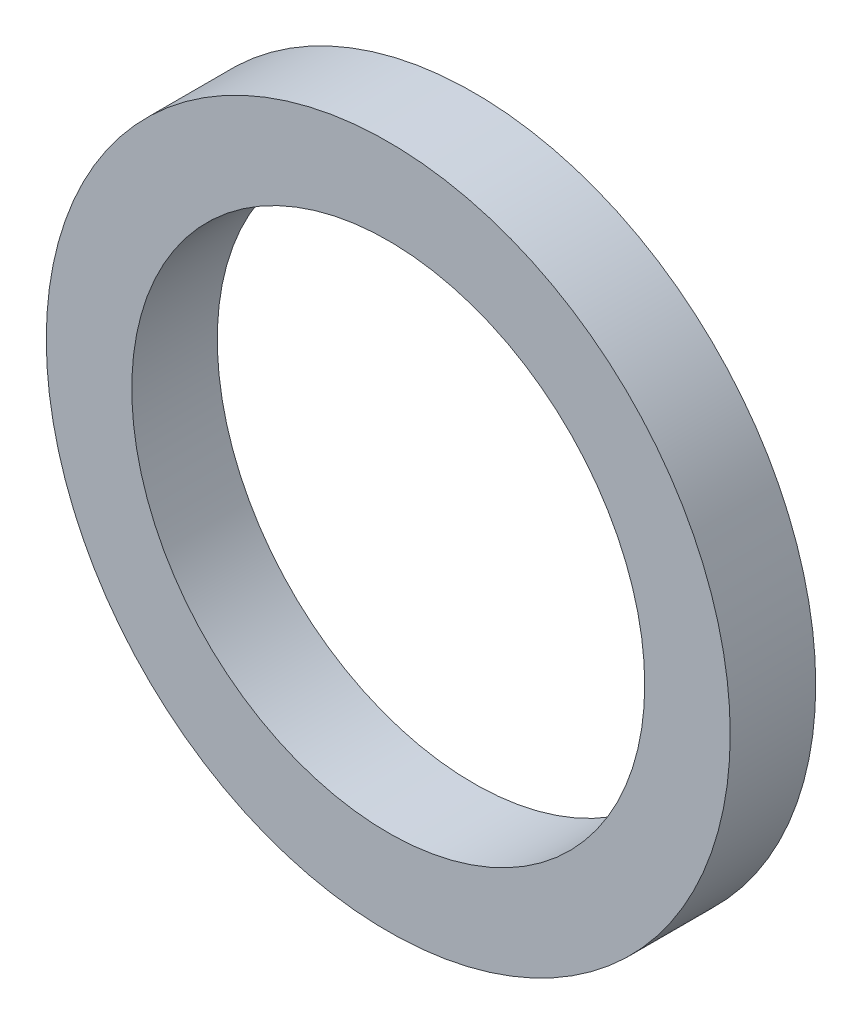
ISO-10303-21;
HEADER;
FILE_DESCRIPTION(('STEP AP214'),'2;1');
FILE_NAME('part.step','',(''),(''),'','','');
FILE_SCHEMA(('AUTOMOTIVE_DESIGN { 1 0 10303 214 1 1 1 1 }'));
ENDSEC;
DATA;
#1=APPLICATION_CONTEXT('core data for automotive mechanical design processes');
#2=APPLICATION_PROTOCOL_DEFINITION('international standard','automotive_design',2000,#1);
#3=PRODUCT_CONTEXT('',#1,'mechanical');
#4=PRODUCT('Part','Part','',(#3));
#5=PRODUCT_RELATED_PRODUCT_CATEGORY('part','',(#4));
#6=PRODUCT_DEFINITION_FORMATION('','',#4);
#7=PRODUCT_DEFINITION_CONTEXT('part definition',#1,'design');
#8=PRODUCT_DEFINITION('design','',#6,#7);
#9=PRODUCT_DEFINITION_SHAPE('','',#8);
#10=(LENGTH_UNIT() NAMED_UNIT(*) SI_UNIT(.MILLI.,.METRE.));
#11=(NAMED_UNIT(*) PLANE_ANGLE_UNIT() SI_UNIT($,.RADIAN.));
#12=(NAMED_UNIT(*) SI_UNIT($,.STERADIAN.) SOLID_ANGLE_UNIT());
#13=UNCERTAINTY_MEASURE_WITH_UNIT(LENGTH_MEASURE(1.E-05),#10,'distance_accuracy_value','');
#14=(GEOMETRIC_REPRESENTATION_CONTEXT(3) GLOBAL_UNCERTAINTY_ASSIGNED_CONTEXT((#13)) GLOBAL_UNIT_ASSIGNED_CONTEXT((#10,
#11,#12)) REPRESENTATION_CONTEXT('',''));
#15=CARTESIAN_POINT('',(0.,0.,0.));
#16=DIRECTION('',(0.,0.,1.));
#17=DIRECTION('',(1.,0.,0.));
#18=AXIS2_PLACEMENT_3D('',#15,#16,#17);
#19=CARTESIAN_POINT('',(0.,0.,3.175));
#20=DIRECTION('',(0.,0.,1.));
#21=DIRECTION('',(1.,0.,0.));
#22=AXIS2_PLACEMENT_3D('',#19,#20,#21);
#23=PLANE('',#22);
#24=CARTESIAN_POINT('',(0.,0.,3.175));
#25=DIRECTION('',(0.,0.,1.));
#26=DIRECTION('',(1.,0.,0.));
#27=AXIS2_PLACEMENT_3D('',#24,#25,#26);
#28=CIRCLE('',#27,12.7);
#29=CARTESIAN_POINT('',(12.7,0.,3.175));
#30=VERTEX_POINT('',#29);
#31=EDGE_CURVE('E10',#30,#30,#28,.T.);
#32=ORIENTED_EDGE('',*,*,#31,.T.);
#33=EDGE_LOOP('',(#32));
#34=FACE_BOUND('',#33,.T.);
#35=CARTESIAN_POINT('',(0.,0.,3.175));
#36=DIRECTION('',(0.,0.,1.));
#37=DIRECTION('',(1.,0.,0.));
#38=AXIS2_PLACEMENT_3D('',#35,#36,#37);
#39=CIRCLE('',#38,9.525);
#40=CARTESIAN_POINT('',(9.525,0.,3.175));
#41=VERTEX_POINT('',#40);
#42=EDGE_CURVE('E42',#41,#41,#39,.T.);
#43=ORIENTED_EDGE('',*,*,#42,.F.);
#44=EDGE_LOOP('',(#43));
#45=FACE_BOUND('',#44,.T.);
#46=ADVANCED_FACE('F31',(#34,#45),#23,.T.);
#47=CARTESIAN_POINT('',(0.,0.,0.));
#48=DIRECTION('',(0.,0.,1.));
#49=DIRECTION('',(1.,0.,0.));
#50=AXIS2_PLACEMENT_3D('',#47,#48,#49);
#51=PLANE('',#50);
#52=CARTESIAN_POINT('',(0.,0.,0.));
#53=DIRECTION('',(0.,0.,1.));
#54=DIRECTION('',(1.,0.,0.));
#55=AXIS2_PLACEMENT_3D('',#52,#53,#54);
#56=CIRCLE('',#55,12.7);
#57=CARTESIAN_POINT('',(12.7,0.,0.));
#58=VERTEX_POINT('',#57);
#59=EDGE_CURVE('E35',#58,#58,#56,.T.);
#60=ORIENTED_EDGE('',*,*,#59,.F.);
#61=EDGE_LOOP('',(#60));
#62=FACE_BOUND('',#61,.T.);
#63=CARTESIAN_POINT('',(0.,0.,0.));
#64=DIRECTION('',(0.,0.,1.));
#65=DIRECTION('',(1.,0.,0.));
#66=AXIS2_PLACEMENT_3D('',#63,#64,#65);
#67=CIRCLE('',#66,9.525);
#68=CARTESIAN_POINT('',(9.525,0.,0.));
#69=VERTEX_POINT('',#68);
#70=EDGE_CURVE('E44',#69,#69,#67,.T.);
#71=ORIENTED_EDGE('',*,*,#70,.T.);
#72=EDGE_LOOP('',(#71));
#73=FACE_BOUND('',#72,.T.);
#74=ADVANCED_FACE('F54',(#62,#73),#51,.F.);
#75=CARTESIAN_POINT('',(0.,0.,3.175));
#76=DIRECTION('',(0.,0.,-1.));
#77=DIRECTION('',(-1.,0.,0.));
#78=AXIS2_PLACEMENT_3D('',#75,#76,#77);
#79=CYLINDRICAL_SURFACE('',#78,12.7);
#80=ORIENTED_EDGE('',*,*,#31,.F.);
#81=EDGE_LOOP('',(#80));
#82=FACE_BOUND('',#81,.T.);
#83=ORIENTED_EDGE('',*,*,#59,.T.);
#84=EDGE_LOOP('',(#83));
#85=FACE_BOUND('',#84,.T.);
#86=ADVANCED_FACE('F33',(#82,#85),#79,.T.);
#87=CARTESIAN_POINT('',(0.,0.,3.175));
#88=DIRECTION('',(0.,0.,-1.));
#89=DIRECTION('',(-1.,0.,0.));
#90=AXIS2_PLACEMENT_3D('',#87,#88,#89);
#91=CYLINDRICAL_SURFACE('',#90,9.525);
#92=ORIENTED_EDGE('',*,*,#42,.T.);
#93=EDGE_LOOP('',(#92));
#94=FACE_BOUND('',#93,.T.);
#95=ORIENTED_EDGE('',*,*,#70,.F.);
#96=EDGE_LOOP('',(#95));
#97=FACE_BOUND('',#96,.T.);
#98=ADVANCED_FACE('F50',(#94,#97),#91,.F.);
#99=CLOSED_SHELL('',(#46,#74,#86,#98));
#100=MANIFOLD_SOLID_BREP('B2',#99);
#101=ADVANCED_BREP_SHAPE_REPRESENTATION('',(#18,#100),#14);
#102=SHAPE_DEFINITION_REPRESENTATION(#9,#101);
ENDSEC;
END-ISO-10303-21;
